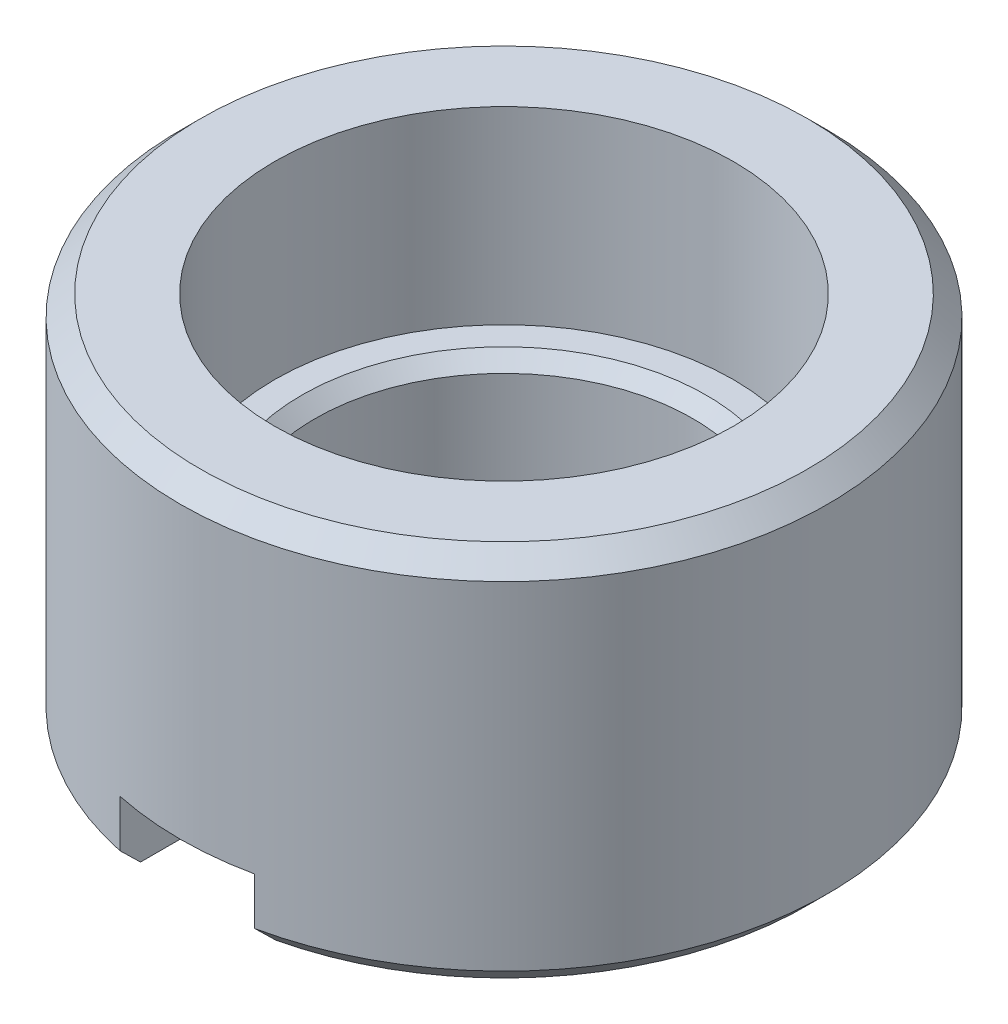
ISO-10303-21;
HEADER;
FILE_DESCRIPTION(('STEP AP214'),'2;1');
FILE_NAME('part.step','',(''),(''),'','','');
FILE_SCHEMA(('AUTOMOTIVE_DESIGN { 1 0 10303 214 1 1 1 1 }'));
ENDSEC;
DATA;
#1=APPLICATION_CONTEXT('core data for automotive mechanical design processes');
#2=APPLICATION_PROTOCOL_DEFINITION('international standard','automotive_design',2000,#1);
#3=PRODUCT_CONTEXT('',#1,'mechanical');
#4=PRODUCT('Part','Part','',(#3));
#5=PRODUCT_RELATED_PRODUCT_CATEGORY('part','',(#4));
#6=PRODUCT_DEFINITION_FORMATION('','',#4);
#7=PRODUCT_DEFINITION_CONTEXT('part definition',#1,'design');
#8=PRODUCT_DEFINITION('design','',#6,#7);
#9=PRODUCT_DEFINITION_SHAPE('','',#8);
#10=(LENGTH_UNIT() NAMED_UNIT(*) SI_UNIT(.MILLI.,.METRE.));
#11=(NAMED_UNIT(*) PLANE_ANGLE_UNIT() SI_UNIT($,.RADIAN.));
#12=(NAMED_UNIT(*) SI_UNIT($,.STERADIAN.) SOLID_ANGLE_UNIT());
#13=UNCERTAINTY_MEASURE_WITH_UNIT(LENGTH_MEASURE(1.E-05),#10,'distance_accuracy_value','');
#14=(GEOMETRIC_REPRESENTATION_CONTEXT(3) GLOBAL_UNCERTAINTY_ASSIGNED_CONTEXT((#13)) GLOBAL_UNIT_ASSIGNED_CONTEXT((#10,
#11,#12)) REPRESENTATION_CONTEXT('',''));
#15=CARTESIAN_POINT('',(0.,0.,0.));
#16=DIRECTION('',(0.,0.,1.));
#17=DIRECTION('',(1.,0.,0.));
#18=AXIS2_PLACEMENT_3D('',#15,#16,#17);
#19=CARTESIAN_POINT('',(0.,1.39999999987594,0.));
#20=DIRECTION('',(0.,1.,0.));
#21=DIRECTION('',(0.,0.,1.));
#22=AXIS2_PLACEMENT_3D('',#19,#20,#21);
#23=CONICAL_SURFACE('',#22,1.49999999990769,0.785398163397448);
#24=CARTESIAN_POINT('',(0.,1.39999999993279,0.));
#25=DIRECTION('',(0.,1.,0.));
#26=DIRECTION('',(0.,0.,1.));
#27=AXIS2_PLACEMENT_3D('',#24,#25,#26);
#28=CIRCLE('',#27,1.49999999996453);
#29=CARTESIAN_POINT('',(0.,1.39999999993279,1.49999999996453));
#30=VERTEX_POINT('',#29);
#31=EDGE_CURVE('E95',#30,#30,#28,.T.);
#32=ORIENTED_EDGE('',*,*,#31,.T.);
#33=EDGE_LOOP('',(#32));
#34=FACE_BOUND('',#33,.T.);
#35=CARTESIAN_POINT('',(0.,1.3,0.));
#36=DIRECTION('',(0.,1.,0.));
#37=DIRECTION('',(0.,0.,1.));
#38=AXIS2_PLACEMENT_3D('',#35,#36,#37);
#39=CIRCLE('',#38,1.4);
#40=CARTESIAN_POINT('',(0.,1.3,1.4));
#41=VERTEX_POINT('',#40);
#42=EDGE_CURVE('E92',#41,#41,#39,.F.);
#43=ORIENTED_EDGE('',*,*,#42,.T.);
#44=EDGE_LOOP('',(#43));
#45=FACE_BOUND('',#44,.T.);
#46=ADVANCED_FACE('F17',(#34,#45),#23,.F.);
#47=CARTESIAN_POINT('',(0.,0.,0.));
#48=DIRECTION('',(0.,1.,0.));
#49=DIRECTION('',(0.,0.,1.));
#50=AXIS2_PLACEMENT_3D('',#47,#48,#49);
#51=CYLINDRICAL_SURFACE('',#50,1.4);
#52=DIRECTION('',(0.,1.,0.));
#53=VECTOR('',#52,1.);
#54=CARTESIAN_POINT('',(-0.500000049687491,0.,1.30766966406371));
#55=LINE('',#54,#53);
#56=CARTESIAN_POINT('',(-0.500000024843746,0.149999972243653,1.30766970334456));
#57=VERTEX_POINT('',#56);
#58=CARTESIAN_POINT('',(-0.500000024843746,0.5,1.30766967356296));
#59=VERTEX_POINT('',#58);
#60=EDGE_CURVE('E66',#57,#59,#55,.T.);
#61=ORIENTED_EDGE('',*,*,#60,.F.);
#62=CARTESIAN_POINT('',(0.,0.150000000076034,0.));
#63=DIRECTION('',(0.,-1.,0.));
#64=DIRECTION('',(0.,0.,-1.));
#65=AXIS2_PLACEMENT_3D('',#62,#63,#64);
#66=CIRCLE('',#65,1.40000000004648);
#67=CARTESIAN_POINT('',(0.500000000000068,0.150000526245604,1.30766968306218));
#68=VERTEX_POINT('',#67);
#69=EDGE_CURVE('E91',#57,#68,#66,.T.);
#70=ORIENTED_EDGE('',*,*,#69,.T.);
#71=DIRECTION('',(0.,1.,0.));
#72=VECTOR('',#71,1.);
#73=CARTESIAN_POINT('',(0.500000000000068,0.,1.30766968306218));
#74=LINE('',#73,#72);
#75=CARTESIAN_POINT('',(0.500000000000034,0.5,1.30766968306219));
#76=VERTEX_POINT('',#75);
#77=EDGE_CURVE('E78',#76,#68,#74,.F.);
#78=ORIENTED_EDGE('',*,*,#77,.F.);
#79=CARTESIAN_POINT('',(0.,0.5,0.));
#80=DIRECTION('',(0.,1.,0.));
#81=DIRECTION('',(0.,0.,1.));
#82=AXIS2_PLACEMENT_3D('',#79,#80,#81);
#83=CIRCLE('',#82,1.4);
#84=EDGE_CURVE('E71',#59,#76,#83,.T.);
#85=ORIENTED_EDGE('',*,*,#84,.F.);
#86=EDGE_LOOP('',(#61,#70,#78,#85));
#87=FACE_BOUND('',#86,.T.);
#88=ORIENTED_EDGE('',*,*,#42,.F.);
#89=EDGE_LOOP('',(#88));
#90=FACE_BOUND('',#89,.T.);
#91=ADVANCED_FACE('F89',(#87,#90),#51,.F.);
#92=CARTESIAN_POINT('',(0.,1.4,0.));
#93=DIRECTION('',(0.,-1.,0.));
#94=DIRECTION('',(0.,0.,-1.));
#95=AXIS2_PLACEMENT_3D('',#92,#93,#94);
#96=PLANE('',#95);
#97=ORIENTED_EDGE('',*,*,#31,.F.);
#98=EDGE_LOOP('',(#97));
#99=FACE_BOUND('',#98,.T.);
#100=CARTESIAN_POINT('',(0.,1.4,0.));
#101=DIRECTION('',(0.,-1.,0.));
#102=DIRECTION('',(0.,0.,-1.));
#103=AXIS2_PLACEMENT_3D('',#100,#101,#102);
#104=CIRCLE('',#103,1.7);
#105=CARTESIAN_POINT('',(0.,1.4,-1.7));
#106=VERTEX_POINT('',#105);
#107=EDGE_CURVE('E156',#106,#106,#104,.F.);
#108=ORIENTED_EDGE('',*,*,#107,.T.);
#109=EDGE_LOOP('',(#108));
#110=FACE_BOUND('',#109,.T.);
#111=ADVANCED_FACE('F168',(#99,#110),#96,.F.);
#112=CARTESIAN_POINT('',(0.,-1.25737642520107E-07,0.));
#113=DIRECTION('',(0.,-1.,0.));
#114=DIRECTION('',(0.,0.,-1.));
#115=AXIS2_PLACEMENT_3D('',#112,#113,#114);
#116=CONICAL_SURFACE('',#115,1.55000012580331,0.785398163207971);
#117=CARTESIAN_POINT('',(0.500000150965075,0.150000557764687,1.30766925689492));
#118=CARTESIAN_POINT('',(0.500000075482534,0.125088264469827,1.33433036562248));
#119=CARTESIAN_POINT('',(0.500000025160842,0.100132057977954,1.36095016896167));
#120=CARTESIAN_POINT('',(0.499999974839165,0.050131825499216,1.41410715752872));
#121=CARTESIAN_POINT('',(0.499999974839165,0.0250877995365869,1.44064434277938));
#122=CARTESIAN_POINT('',(0.5,-1.39598817834691E-07,1.46714022266446));
#123=B_SPLINE_CURVE_WITH_KNOTS('',3,(#117,#118,#119,#120,#121,#122),.UNSPECIFIED.,.F.,.F.,(4,2,
4),(0.,0.109466138830978,0.218932247453688),.UNSPECIFIED.);
#124=CARTESIAN_POINT('',(0.5,-1.32635628205558E-07,1.46714021530801));
#125=VERTEX_POINT('',#124);
#126=EDGE_CURVE('E148',#68,#125,#123,.T.);
#127=ORIENTED_EDGE('',*,*,#126,.F.);
#128=ORIENTED_EDGE('',*,*,#69,.F.);
#129=CARTESIAN_POINT('',(-0.499999940439556,4.58525842205285E-07,1.46713952206922));
#130=CARTESIAN_POINT('',(-0.499999970219776,0.0250882342108714,1.44064387602359));
#131=CARTESIAN_POINT('',(-0.499999990073258,0.0501320774970384,1.41410690655435));
#132=CARTESIAN_POINT('',(-0.500000009926745,0.100131906200567,1.36095031340224));
#133=CARTESIAN_POINT('',(-0.500000009926745,0.125087891593576,1.33433068969648));
#134=CARTESIAN_POINT('',(-0.5,0.14999994456337,1.30766974254419));
#135=B_SPLINE_CURVE_WITH_KNOTS('',3,(#129,#130,#131,#132,#133,#134),.UNSPECIFIED.,.F.,.F.,(4,2,
4),(0.,0.109465261687842,0.218930553714826),.UNSPECIFIED.);
#136=CARTESIAN_POINT('',(-0.5,2.46437999825415E-07,1.46713981482537));
#137=VERTEX_POINT('',#136);
#138=EDGE_CURVE('E157',#137,#57,#135,.T.);
#139=ORIENTED_EDGE('',*,*,#138,.F.);
#140=CARTESIAN_POINT('',(0.,-1.25737642520107E-07,0.));
#141=DIRECTION('',(0.,-1.,0.));
#142=DIRECTION('',(0.,0.,-1.));
#143=AXIS2_PLACEMENT_3D('',#140,#141,#142);
#144=CIRCLE('',#143,1.55000012580331);
#145=EDGE_CURVE('E204',#137,#125,#144,.T.);
#146=ORIENTED_EDGE('',*,*,#145,.T.);
#147=EDGE_LOOP('',(#127,#128,#139,#146));
#148=FACE_BOUND('',#147,.T.);
#149=ADVANCED_FACE('F163',(#148),#116,.F.);
#150=CARTESIAN_POINT('',(0.,2.8,0.));
#151=DIRECTION('',(0.,-1.,0.));
#152=DIRECTION('',(0.,0.,-1.));
#153=AXIS2_PLACEMENT_3D('',#150,#151,#152);
#154=CYLINDRICAL_SURFACE('',#153,1.7);
#155=CARTESIAN_POINT('',(0.,2.8,0.));
#156=DIRECTION('',(0.,-1.,0.));
#157=DIRECTION('',(0.,0.,-1.));
#158=AXIS2_PLACEMENT_3D('',#155,#156,#157);
#159=CIRCLE('',#158,1.7);
#160=CARTESIAN_POINT('',(0.,2.8,-1.7));
#161=VERTEX_POINT('',#160);
#162=EDGE_CURVE('E87',#161,#161,#159,.T.);
#163=ORIENTED_EDGE('',*,*,#162,.F.);
#164=EDGE_LOOP('',(#163));
#165=FACE_BOUND('',#164,.T.);
#166=ORIENTED_EDGE('',*,*,#107,.F.);
#167=EDGE_LOOP('',(#166));
#168=FACE_BOUND('',#167,.T.);
#169=ADVANCED_FACE('F167',(#165,#168),#154,.F.);
#170=CARTESIAN_POINT('',(0.,0.,0.));
#171=DIRECTION('',(0.,1.,0.));
#172=DIRECTION('',(0.,0.,1.));
#173=AXIS2_PLACEMENT_3D('',#170,#171,#172);
#174=PLANE('',#173);
#175=ORIENTED_EDGE('',*,*,#145,.F.);
#176=DIRECTION('',(0.,0.,1.));
#177=VECTOR('',#176,1.);
#178=CARTESIAN_POINT('',(-0.5,0.,3.));
#179=LINE('',#178,#177);
#180=CARTESIAN_POINT('',(-0.5,2.83891428883483E-11,2.19374109682258));
#181=VERTEX_POINT('',#180);
#182=EDGE_CURVE('E209',#137,#181,#179,.T.);
#183=ORIENTED_EDGE('',*,*,#182,.T.);
#184=CARTESIAN_POINT('',(0.,5.6843418860808E-11,0.));
#185=DIRECTION('',(0.,1.,0.));
#186=DIRECTION('',(0.,0.,1.));
#187=AXIS2_PLACEMENT_3D('',#184,#185,#186);
#188=CIRCLE('',#187,2.25000000000364);
#189=CARTESIAN_POINT('',(0.5,2.8421709430404E-11,2.19374109682261));
#190=VERTEX_POINT('',#189);
#191=EDGE_CURVE('E117',#190,#181,#188,.T.);
#192=ORIENTED_EDGE('',*,*,#191,.F.);
#193=DIRECTION('',(0.,0.,-1.));
#194=VECTOR('',#193,1.);
#195=CARTESIAN_POINT('',(0.5,0.,0.));
#196=LINE('',#195,#194);
#197=EDGE_CURVE('E206',#190,#125,#196,.T.);
#198=ORIENTED_EDGE('',*,*,#197,.T.);
#199=EDGE_LOOP('',(#175,#183,#192,#198));
#200=FACE_BOUND('',#199,.T.);
#201=ADVANCED_FACE('F144',(#200),#174,.F.);
#202=CARTESIAN_POINT('',(0.5,0.,0.));
#203=DIRECTION('',(1.,0.,0.));
#204=DIRECTION('',(0.,0.,-1.));
#205=AXIS2_PLACEMENT_3D('',#202,#203,#204);
#206=PLANE('',#205);
#207=DIRECTION('',(0.,1.,0.));
#208=VECTOR('',#207,1.);
#209=CARTESIAN_POINT('',(0.50000000000002,0.,2.3473389188611));
#210=LINE('',#209,#208);
#211=CARTESIAN_POINT('',(0.50000000000001,0.5,2.3473389188611));
#212=VERTEX_POINT('',#211);
#213=CARTESIAN_POINT('',(0.50000000000001,0.150000000011783,2.34733891884595));
#214=VERTEX_POINT('',#213);
#215=EDGE_CURVE('E86',#212,#214,#210,.F.);
#216=ORIENTED_EDGE('',*,*,#215,.F.);
#217=DIRECTION('',(0.,0.,-1.));
#218=VECTOR('',#217,1.);
#219=CARTESIAN_POINT('',(0.5,0.5,0.));
#220=LINE('',#219,#218);
#221=EDGE_CURVE('E74',#76,#212,#220,.F.);
#222=ORIENTED_EDGE('',*,*,#221,.F.);
#223=ORIENTED_EDGE('',*,*,#77,.T.);
#224=ORIENTED_EDGE('',*,*,#126,.T.);
#225=ORIENTED_EDGE('',*,*,#197,.F.);
#226=CARTESIAN_POINT('',(0.5,0.150000000023567,2.3473389188308));
#227=CARTESIAN_POINT('',(0.5,0.124979961149474,2.32175885157336));
#228=CARTESIAN_POINT('',(0.5,0.0999699417759317,2.29616899950868));
#229=CARTESIAN_POINT('',(0.5,0.049969941782863,2.24496972551179));
#230=CARTESIAN_POINT('',(0.5,0.0249799611635349,2.2193603035794));
#231=CARTESIAN_POINT('',(0.5,4.49548703582652E-11,2.19374109683957));
#232=B_SPLINE_CURVE_WITH_KNOTS('',3,(#226,#227,#228,#229,#230,#231),.UNSPECIFIED.,.F.,.F.,(4,2,
4),(0.,0.107345583885959,0.21469116883285),.UNSPECIFIED.);
#233=EDGE_CURVE('E133',#214,#190,#232,.T.);
#234=ORIENTED_EDGE('',*,*,#233,.F.);
#235=EDGE_LOOP('',(#216,#222,#223,#224,#225,#234));
#236=FACE_BOUND('',#235,.T.);
#237=ADVANCED_FACE('F82',(#236),#206,.F.);
#238=CARTESIAN_POINT('',(-0.5,0.,3.));
#239=DIRECTION('',(-1.,0.,0.));
#240=DIRECTION('',(0.,0.,1.));
#241=AXIS2_PLACEMENT_3D('',#238,#239,#240);
#242=PLANE('',#241);
#243=ORIENTED_EDGE('',*,*,#60,.T.);
#244=DIRECTION('',(0.,0.,-1.));
#245=VECTOR('',#244,1.);
#246=CARTESIAN_POINT('',(-0.5,0.5,0.));
#247=LINE('',#246,#245);
#248=CARTESIAN_POINT('',(-0.500000000000011,0.5,2.3473389188611));
#249=VERTEX_POINT('',#248);
#250=EDGE_CURVE('E35',#249,#59,#247,.T.);
#251=ORIENTED_EDGE('',*,*,#250,.F.);
#252=DIRECTION('',(0.,1.,0.));
#253=VECTOR('',#252,1.);
#254=CARTESIAN_POINT('',(-0.500000000000022,0.,2.3473389188611));
#255=LINE('',#254,#253);
#256=CARTESIAN_POINT('',(-0.500000000000011,0.150000000011783,2.34733891884595));
#257=VERTEX_POINT('',#256);
#258=EDGE_CURVE('E107',#257,#249,#255,.T.);
#259=ORIENTED_EDGE('',*,*,#258,.F.);
#260=CARTESIAN_POINT('',(-0.5,4.51237056168315E-11,2.19374109683974));
#261=CARTESIAN_POINT('',(-0.5,0.0249799611636757,2.21936030357955));
#262=CARTESIAN_POINT('',(-0.5,0.0499699417829756,2.24496972551191));
#263=CARTESIAN_POINT('',(-0.5,0.0999699417759879,2.29616899950873));
#264=CARTESIAN_POINT('',(-0.5,0.124979961149502,2.32175885157339));
#265=CARTESIAN_POINT('',(-0.5,0.150000000023567,2.3473389188308));
#266=B_SPLINE_CURVE_WITH_KNOTS('',3,(#260,#261,#262,#263,#264,#265),.UNSPECIFIED.,.F.,.F.,(4,2,
4),(0.,0.10734558494677,0.214691168832608),.UNSPECIFIED.);
#267=EDGE_CURVE('E108',#181,#257,#266,.T.);
#268=ORIENTED_EDGE('',*,*,#267,.F.);
#269=ORIENTED_EDGE('',*,*,#182,.F.);
#270=ORIENTED_EDGE('',*,*,#138,.T.);
#271=EDGE_LOOP('',(#243,#251,#259,#268,#269,#270));
#272=FACE_BOUND('',#271,.T.);
#273=ADVANCED_FACE('F119',(#272),#242,.F.);
#274=CARTESIAN_POINT('',(0.,0.5,0.));
#275=DIRECTION('',(0.,-1.,0.));
#276=DIRECTION('',(0.,0.,-1.));
#277=AXIS2_PLACEMENT_3D('',#274,#275,#276);
#278=PLANE('',#277);
#279=ORIENTED_EDGE('',*,*,#221,.T.);
#280=CARTESIAN_POINT('',(0.,0.5,0.));
#281=DIRECTION('',(0.,1.,0.));
#282=DIRECTION('',(0.,0.,1.));
#283=AXIS2_PLACEMENT_3D('',#280,#281,#282);
#284=CIRCLE('',#283,2.4);
#285=EDGE_CURVE('E105',#249,#212,#284,.T.);
#286=ORIENTED_EDGE('',*,*,#285,.F.);
#287=ORIENTED_EDGE('',*,*,#250,.T.);
#288=ORIENTED_EDGE('',*,*,#84,.T.);
#289=EDGE_LOOP('',(#279,#286,#287,#288));
#290=FACE_BOUND('',#289,.T.);
#291=ADVANCED_FACE('F73',(#290),#278,.T.);
#292=CARTESIAN_POINT('',(0.,2.8,0.));
#293=DIRECTION('',(0.,1.,0.));
#294=DIRECTION('',(0.,0.,1.));
#295=AXIS2_PLACEMENT_3D('',#292,#293,#294);
#296=PLANE('',#295);
#297=ORIENTED_EDGE('',*,*,#162,.T.);
#298=EDGE_LOOP('',(#297));
#299=FACE_BOUND('',#298,.T.);
#300=CARTESIAN_POINT('',(0.,2.79999999992242,0.));
#301=DIRECTION('',(0.,-1.,0.));
#302=DIRECTION('',(0.,0.,-1.));
#303=AXIS2_PLACEMENT_3D('',#300,#301,#302);
#304=CIRCLE('',#303,2.25000000000364);
#305=CARTESIAN_POINT('',(0.,2.79999999992242,-2.25000000000364));
#306=VERTEX_POINT('',#305);
#307=EDGE_CURVE('E102',#306,#306,#304,.T.);
#308=ORIENTED_EDGE('',*,*,#307,.F.);
#309=EDGE_LOOP('',(#308));
#310=FACE_BOUND('',#309,.T.);
#311=ADVANCED_FACE('F129',(#299,#310),#296,.T.);
#312=CARTESIAN_POINT('',(0.,0.149999999962347,0.));
#313=DIRECTION('',(0.,1.,0.));
#314=DIRECTION('',(0.,0.,1.));
#315=AXIS2_PLACEMENT_3D('',#312,#313,#314);
#316=CONICAL_SURFACE('',#315,2.39999999990914,0.785398163397448);
#317=ORIENTED_EDGE('',*,*,#267,.T.);
#318=CARTESIAN_POINT('',(0.,0.15,0.));
#319=DIRECTION('',(0.,1.,0.));
#320=DIRECTION('',(0.,0.,1.));
#321=AXIS2_PLACEMENT_3D('',#318,#319,#320);
#322=CIRCLE('',#321,2.4);
#323=EDGE_CURVE('E26',#214,#257,#322,.T.);
#324=ORIENTED_EDGE('',*,*,#323,.F.);
#325=ORIENTED_EDGE('',*,*,#233,.T.);
#326=ORIENTED_EDGE('',*,*,#191,.T.);
#327=EDGE_LOOP('',(#317,#324,#325,#326));
#328=FACE_BOUND('',#327,.T.);
#329=ADVANCED_FACE('F123',(#328),#316,.T.);
#330=CARTESIAN_POINT('',(0.,2.65000000001692,0.));
#331=DIRECTION('',(0.,-1.,0.));
#332=DIRECTION('',(0.,0.,-1.));
#333=AXIS2_PLACEMENT_3D('',#330,#331,#332);
#334=CONICAL_SURFACE('',#333,2.39999999990914,0.785398163397448);
#335=CARTESIAN_POINT('',(0.,2.65,0.));
#336=DIRECTION('',(0.,1.,0.));
#337=DIRECTION('',(0.,0.,1.));
#338=AXIS2_PLACEMENT_3D('',#335,#336,#337);
#339=CIRCLE('',#338,2.4);
#340=CARTESIAN_POINT('',(0.,2.65,2.4));
#341=VERTEX_POINT('',#340);
#342=EDGE_CURVE('E11',#341,#341,#339,.F.);
#343=ORIENTED_EDGE('',*,*,#342,.F.);
#344=EDGE_LOOP('',(#343));
#345=FACE_BOUND('',#344,.T.);
#346=ORIENTED_EDGE('',*,*,#307,.T.);
#347=EDGE_LOOP('',(#346));
#348=FACE_BOUND('',#347,.T.);
#349=ADVANCED_FACE('F128',(#345,#348),#334,.T.);
#350=CARTESIAN_POINT('',(0.,0.,0.));
#351=DIRECTION('',(0.,1.,0.));
#352=DIRECTION('',(0.,0.,1.));
#353=AXIS2_PLACEMENT_3D('',#350,#351,#352);
#354=CYLINDRICAL_SURFACE('',#353,2.4);
#355=ORIENTED_EDGE('',*,*,#215,.T.);
#356=ORIENTED_EDGE('',*,*,#323,.T.);
#357=ORIENTED_EDGE('',*,*,#258,.T.);
#358=ORIENTED_EDGE('',*,*,#285,.T.);
#359=EDGE_LOOP('',(#355,#356,#357,#358));
#360=FACE_BOUND('',#359,.T.);
#361=ORIENTED_EDGE('',*,*,#342,.T.);
#362=EDGE_LOOP('',(#361));
#363=FACE_BOUND('',#362,.T.);
#364=ADVANCED_FACE('F179',(#360,#363),#354,.T.);
#365=CLOSED_SHELL('',(#46,#91,#111,#149,#169,#201,#237,#273,#291,#311,#329,#349,#364));
#366=MANIFOLD_SOLID_BREP('B1',#365);
#367=ADVANCED_BREP_SHAPE_REPRESENTATION('',(#18,#366),#14);
#368=SHAPE_DEFINITION_REPRESENTATION(#9,#367);
ENDSEC;
END-ISO-10303-21;
